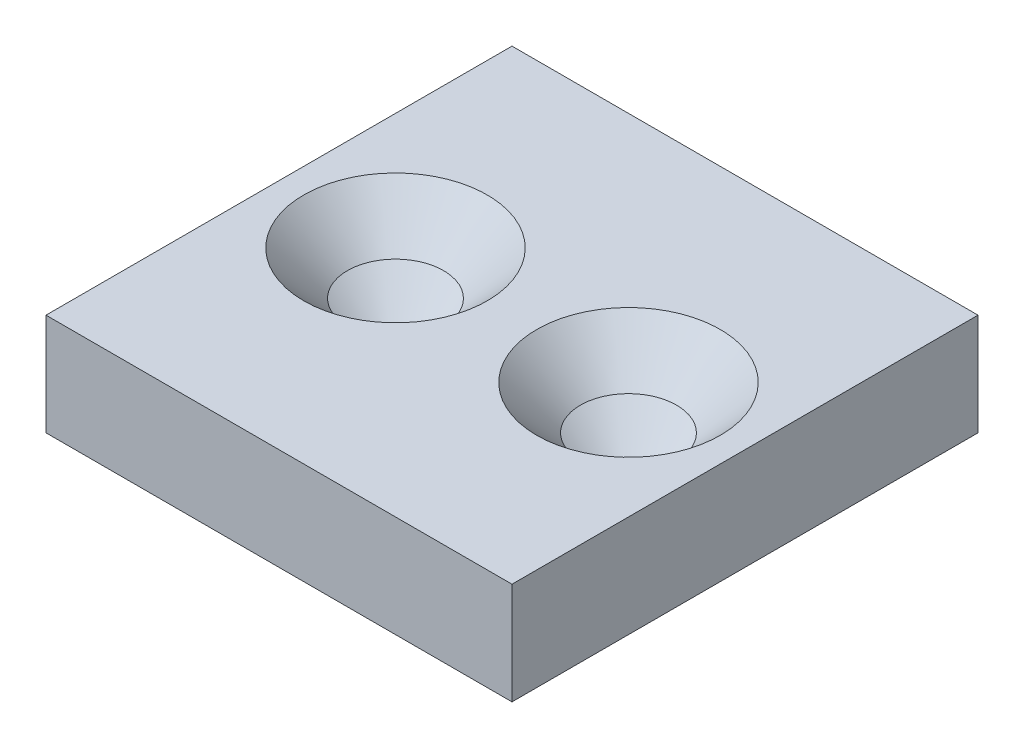
ISO-10303-21;
HEADER;
FILE_DESCRIPTION(('STEP AP214'),'2;1');
FILE_NAME('part.step','',(''),(''),'','','');
FILE_SCHEMA(('AUTOMOTIVE_DESIGN { 1 0 10303 214 1 1 1 1 }'));
ENDSEC;
DATA;
#1=APPLICATION_CONTEXT('core data for automotive mechanical design processes');
#2=APPLICATION_PROTOCOL_DEFINITION('international standard','automotive_design',2000,#1);
#3=PRODUCT_CONTEXT('',#1,'mechanical');
#4=PRODUCT('Part','Part','',(#3));
#5=PRODUCT_RELATED_PRODUCT_CATEGORY('part','',(#4));
#6=PRODUCT_DEFINITION_FORMATION('','',#4);
#7=PRODUCT_DEFINITION_CONTEXT('part definition',#1,'design');
#8=PRODUCT_DEFINITION('design','',#6,#7);
#9=PRODUCT_DEFINITION_SHAPE('','',#8);
#10=(LENGTH_UNIT() NAMED_UNIT(*) SI_UNIT(.MILLI.,.METRE.));
#11=(NAMED_UNIT(*) PLANE_ANGLE_UNIT() SI_UNIT($,.RADIAN.));
#12=(NAMED_UNIT(*) SI_UNIT($,.STERADIAN.) SOLID_ANGLE_UNIT());
#13=UNCERTAINTY_MEASURE_WITH_UNIT(LENGTH_MEASURE(1.E-05),#10,'distance_accuracy_value','');
#14=(GEOMETRIC_REPRESENTATION_CONTEXT(3) GLOBAL_UNCERTAINTY_ASSIGNED_CONTEXT((#13)) GLOBAL_UNIT_ASSIGNED_CONTEXT((#10,
#11,#12)) REPRESENTATION_CONTEXT('',''));
#15=CARTESIAN_POINT('',(0.,0.,0.));
#16=DIRECTION('',(0.,0.,1.));
#17=DIRECTION('',(1.,0.,0.));
#18=AXIS2_PLACEMENT_3D('',#15,#16,#17);
#19=CARTESIAN_POINT('',(-16.,7.,16.));
#20=DIRECTION('',(1.,0.,0.));
#21=DIRECTION('',(0.,0.,-1.));
#22=AXIS2_PLACEMENT_3D('',#19,#20,#21);
#23=PLANE('',#22);
#24=DIRECTION('',(0.,0.,1.));
#25=VECTOR('',#24,1.);
#26=CARTESIAN_POINT('',(-16.,0.,16.));
#27=LINE('',#26,#25);
#28=CARTESIAN_POINT('',(-16.,0.,-16.));
#29=VERTEX_POINT('',#28);
#30=CARTESIAN_POINT('',(-16.,0.,16.));
#31=VERTEX_POINT('',#30);
#32=EDGE_CURVE('E107',#29,#31,#27,.T.);
#33=ORIENTED_EDGE('',*,*,#32,.T.);
#34=DIRECTION('',(0.,-1.,0.));
#35=VECTOR('',#34,1.);
#36=CARTESIAN_POINT('',(-16.,7.,16.));
#37=LINE('',#36,#35);
#38=CARTESIAN_POINT('',(-16.,7.,16.));
#39=VERTEX_POINT('',#38);
#40=EDGE_CURVE('E11',#39,#31,#37,.T.);
#41=ORIENTED_EDGE('',*,*,#40,.F.);
#42=DIRECTION('',(0.,0.,1.));
#43=VECTOR('',#42,1.);
#44=CARTESIAN_POINT('',(-16.,7.,16.));
#45=LINE('',#44,#43);
#46=CARTESIAN_POINT('',(-16.,7.,-16.));
#47=VERTEX_POINT('',#46);
#48=EDGE_CURVE('E91',#47,#39,#45,.T.);
#49=ORIENTED_EDGE('',*,*,#48,.F.);
#50=DIRECTION('',(0.,-1.,0.));
#51=VECTOR('',#50,1.);
#52=CARTESIAN_POINT('',(-16.,7.,-16.));
#53=LINE('',#52,#51);
#54=EDGE_CURVE('E103',#47,#29,#53,.T.);
#55=ORIENTED_EDGE('',*,*,#54,.T.);
#56=EDGE_LOOP('',(#33,#41,#49,#55));
#57=FACE_BOUND('',#56,.T.);
#58=ADVANCED_FACE('F39',(#57),#23,.F.);
#59=CARTESIAN_POINT('',(16.,7.,16.));
#60=DIRECTION('',(0.,0.,-1.));
#61=DIRECTION('',(-1.,0.,0.));
#62=AXIS2_PLACEMENT_3D('',#59,#60,#61);
#63=PLANE('',#62);
#64=DIRECTION('',(1.,0.,0.));
#65=VECTOR('',#64,1.);
#66=CARTESIAN_POINT('',(16.,0.,16.));
#67=LINE('',#66,#65);
#68=CARTESIAN_POINT('',(16.,0.,16.));
#69=VERTEX_POINT('',#68);
#70=EDGE_CURVE('E96',#31,#69,#67,.T.);
#71=ORIENTED_EDGE('',*,*,#70,.T.);
#72=DIRECTION('',(0.,-1.,0.));
#73=VECTOR('',#72,1.);
#74=CARTESIAN_POINT('',(16.,7.,16.));
#75=LINE('',#74,#73);
#76=CARTESIAN_POINT('',(16.,7.,16.));
#77=VERTEX_POINT('',#76);
#78=EDGE_CURVE('E48',#77,#69,#75,.T.);
#79=ORIENTED_EDGE('',*,*,#78,.F.);
#80=DIRECTION('',(1.,0.,0.));
#81=VECTOR('',#80,1.);
#82=CARTESIAN_POINT('',(16.,7.,16.));
#83=LINE('',#82,#81);
#84=EDGE_CURVE('E86',#39,#77,#83,.T.);
#85=ORIENTED_EDGE('',*,*,#84,.F.);
#86=ORIENTED_EDGE('',*,*,#40,.T.);
#87=EDGE_LOOP('',(#71,#79,#85,#86));
#88=FACE_BOUND('',#87,.T.);
#89=ADVANCED_FACE('F95',(#88),#63,.F.);
#90=CARTESIAN_POINT('',(16.,7.,16.));
#91=DIRECTION('',(-1.,0.,0.));
#92=DIRECTION('',(0.,0.,1.));
#93=AXIS2_PLACEMENT_3D('',#90,#91,#92);
#94=PLANE('',#93);
#95=DIRECTION('',(0.,0.,-1.));
#96=VECTOR('',#95,1.);
#97=CARTESIAN_POINT('',(16.,0.,16.));
#98=LINE('',#97,#96);
#99=CARTESIAN_POINT('',(16.,0.,-16.));
#100=VERTEX_POINT('',#99);
#101=EDGE_CURVE('E73',#69,#100,#98,.T.);
#102=ORIENTED_EDGE('',*,*,#101,.T.);
#103=DIRECTION('',(0.,-1.,0.));
#104=VECTOR('',#103,1.);
#105=CARTESIAN_POINT('',(16.,7.,-16.));
#106=LINE('',#105,#104);
#107=CARTESIAN_POINT('',(16.,7.,-16.));
#108=VERTEX_POINT('',#107);
#109=EDGE_CURVE('E98',#108,#100,#106,.T.);
#110=ORIENTED_EDGE('',*,*,#109,.F.);
#111=DIRECTION('',(0.,0.,-1.));
#112=VECTOR('',#111,1.);
#113=CARTESIAN_POINT('',(16.,7.,16.));
#114=LINE('',#113,#112);
#115=EDGE_CURVE('E89',#77,#108,#114,.T.);
#116=ORIENTED_EDGE('',*,*,#115,.F.);
#117=ORIENTED_EDGE('',*,*,#78,.T.);
#118=EDGE_LOOP('',(#102,#110,#116,#117));
#119=FACE_BOUND('',#118,.T.);
#120=ADVANCED_FACE('F99',(#119),#94,.F.);
#121=CARTESIAN_POINT('',(16.,7.,-16.));
#122=DIRECTION('',(0.,0.,1.));
#123=DIRECTION('',(1.,0.,0.));
#124=AXIS2_PLACEMENT_3D('',#121,#122,#123);
#125=PLANE('',#124);
#126=DIRECTION('',(-1.,0.,0.));
#127=VECTOR('',#126,1.);
#128=CARTESIAN_POINT('',(16.,0.,-16.));
#129=LINE('',#128,#127);
#130=EDGE_CURVE('E79',#100,#29,#129,.T.);
#131=ORIENTED_EDGE('',*,*,#130,.T.);
#132=ORIENTED_EDGE('',*,*,#54,.F.);
#133=DIRECTION('',(-1.,0.,0.));
#134=VECTOR('',#133,1.);
#135=CARTESIAN_POINT('',(16.,7.,-16.));
#136=LINE('',#135,#134);
#137=EDGE_CURVE('E56',#108,#47,#136,.T.);
#138=ORIENTED_EDGE('',*,*,#137,.F.);
#139=ORIENTED_EDGE('',*,*,#109,.T.);
#140=EDGE_LOOP('',(#131,#132,#138,#139));
#141=FACE_BOUND('',#140,.T.);
#142=ADVANCED_FACE('F121',(#141),#125,.F.);
#143=CARTESIAN_POINT('',(0.,7.,0.));
#144=DIRECTION('',(0.,1.,0.));
#145=DIRECTION('',(0.,0.,1.));
#146=AXIS2_PLACEMENT_3D('',#143,#144,#145);
#147=PLANE('',#146);
#148=CARTESIAN_POINT('',(-7.99999999999999,7.,0.));
#149=DIRECTION('',(0.,1.,0.));
#150=DIRECTION('',(0.,0.,1.));
#151=AXIS2_PLACEMENT_3D('',#148,#149,#150);
#152=CIRCLE('',#151,6.3);
#153=CARTESIAN_POINT('',(-7.99999999999999,7.,6.3));
#154=VERTEX_POINT('',#153);
#155=EDGE_CURVE('E143',#154,#154,#152,.T.);
#156=ORIENTED_EDGE('',*,*,#155,.F.);
#157=EDGE_LOOP('',(#156));
#158=FACE_BOUND('',#157,.T.);
#159=CARTESIAN_POINT('',(8.00000000000001,7.,0.));
#160=DIRECTION('',(0.,1.,0.));
#161=DIRECTION('',(0.,0.,1.));
#162=AXIS2_PLACEMENT_3D('',#159,#160,#161);
#163=CIRCLE('',#162,6.3);
#164=CARTESIAN_POINT('',(8.00000000000001,7.,6.3));
#165=VERTEX_POINT('',#164);
#166=EDGE_CURVE('E111',#165,#165,#163,.T.);
#167=ORIENTED_EDGE('',*,*,#166,.F.);
#168=EDGE_LOOP('',(#167));
#169=FACE_BOUND('',#168,.T.);
#170=ORIENTED_EDGE('',*,*,#48,.T.);
#171=ORIENTED_EDGE('',*,*,#84,.T.);
#172=ORIENTED_EDGE('',*,*,#115,.T.);
#173=ORIENTED_EDGE('',*,*,#137,.T.);
#174=EDGE_LOOP('',(#170,#171,#172,#173));
#175=FACE_BOUND('',#174,.T.);
#176=ADVANCED_FACE('F87',(#158,#169,#175),#147,.T.);
#177=CARTESIAN_POINT('',(0.,0.,0.));
#178=DIRECTION('',(0.,1.,0.));
#179=DIRECTION('',(0.,0.,1.));
#180=AXIS2_PLACEMENT_3D('',#177,#178,#179);
#181=PLANE('',#180);
#182=CARTESIAN_POINT('',(-7.99999999999999,0.,0.));
#183=DIRECTION('',(0.,1.,0.));
#184=DIRECTION('',(0.,0.,1.));
#185=AXIS2_PLACEMENT_3D('',#182,#183,#184);
#186=CIRCLE('',#185,2.3);
#187=CARTESIAN_POINT('',(-7.99999999999999,0.,2.3));
#188=VERTEX_POINT('',#187);
#189=EDGE_CURVE('E155',#188,#188,#186,.T.);
#190=ORIENTED_EDGE('',*,*,#189,.T.);
#191=EDGE_LOOP('',(#190));
#192=FACE_BOUND('',#191,.T.);
#193=CARTESIAN_POINT('',(8.00000000000001,0.,0.));
#194=DIRECTION('',(0.,1.,0.));
#195=DIRECTION('',(0.,0.,1.));
#196=AXIS2_PLACEMENT_3D('',#193,#194,#195);
#197=CIRCLE('',#196,2.3);
#198=CARTESIAN_POINT('',(8.00000000000001,0.,2.3));
#199=VERTEX_POINT('',#198);
#200=EDGE_CURVE('E139',#199,#199,#197,.T.);
#201=ORIENTED_EDGE('',*,*,#200,.T.);
#202=EDGE_LOOP('',(#201));
#203=FACE_BOUND('',#202,.T.);
#204=ORIENTED_EDGE('',*,*,#32,.F.);
#205=ORIENTED_EDGE('',*,*,#130,.F.);
#206=ORIENTED_EDGE('',*,*,#101,.F.);
#207=ORIENTED_EDGE('',*,*,#70,.F.);
#208=EDGE_LOOP('',(#204,#205,#206,#207));
#209=FACE_BOUND('',#208,.T.);
#210=ADVANCED_FACE('F124',(#192,#203,#209),#181,.F.);
#211=CARTESIAN_POINT('',(8.00000000000001,7.,0.));
#212=DIRECTION('',(0.,1.,0.));
#213=DIRECTION('',(0.,0.,1.));
#214=AXIS2_PLACEMENT_3D('',#211,#212,#213);
#215=CONICAL_SURFACE('',#214,6.3,0.785398163397449);
#216=CARTESIAN_POINT('',(8.00000000000001,4.,0.));
#217=DIRECTION('',(0.,1.,0.));
#218=DIRECTION('',(0.,0.,1.));
#219=AXIS2_PLACEMENT_3D('',#216,#217,#218);
#220=CIRCLE('',#219,3.3);
#221=CARTESIAN_POINT('',(8.00000000000001,4.,3.3));
#222=VERTEX_POINT('',#221);
#223=EDGE_CURVE('E131',#222,#222,#220,.T.);
#224=ORIENTED_EDGE('',*,*,#223,.F.);
#225=EDGE_LOOP('',(#224));
#226=FACE_BOUND('',#225,.T.);
#227=ORIENTED_EDGE('',*,*,#166,.T.);
#228=EDGE_LOOP('',(#227));
#229=FACE_BOUND('',#228,.T.);
#230=ADVANCED_FACE('F186',(#226,#229),#215,.F.);
#231=CARTESIAN_POINT('',(14.3,4.,0.));
#232=DIRECTION('',(0.,1.,0.));
#233=DIRECTION('',(0.,0.,1.));
#234=AXIS2_PLACEMENT_3D('',#231,#232,#233);
#235=PLANE('',#234);
#236=CARTESIAN_POINT('',(8.00000000000001,4.,0.));
#237=DIRECTION('',(0.,1.,0.));
#238=DIRECTION('',(0.,0.,1.));
#239=AXIS2_PLACEMENT_3D('',#236,#237,#238);
#240=CIRCLE('',#239,6.3);
#241=CARTESIAN_POINT('',(8.00000000000001,4.,6.3));
#242=VERTEX_POINT('',#241);
#243=EDGE_CURVE('E135',#242,#242,#240,.T.);
#244=ORIENTED_EDGE('',*,*,#243,.F.);
#245=EDGE_LOOP('',(#244));
#246=FACE_BOUND('',#245,.T.);
#247=ORIENTED_EDGE('',*,*,#223,.T.);
#248=EDGE_LOOP('',(#247));
#249=FACE_BOUND('',#248,.T.);
#250=ADVANCED_FACE('F188',(#246,#249),#235,.F.);
#251=CARTESIAN_POINT('',(8.00000000000001,4.,0.));
#252=DIRECTION('',(0.,1.,0.));
#253=DIRECTION('',(0.,0.,1.));
#254=AXIS2_PLACEMENT_3D('',#251,#252,#253);
#255=CONICAL_SURFACE('',#254,6.3,0.785398163397448);
#256=ORIENTED_EDGE('',*,*,#200,.F.);
#257=EDGE_LOOP('',(#256));
#258=FACE_BOUND('',#257,.T.);
#259=ORIENTED_EDGE('',*,*,#243,.T.);
#260=EDGE_LOOP('',(#259));
#261=FACE_BOUND('',#260,.T.);
#262=ADVANCED_FACE('F177',(#258,#261),#255,.F.);
#263=CARTESIAN_POINT('',(-7.99999999999999,7.,0.));
#264=DIRECTION('',(0.,1.,0.));
#265=DIRECTION('',(0.,0.,1.));
#266=AXIS2_PLACEMENT_3D('',#263,#264,#265);
#267=CONICAL_SURFACE('',#266,6.3,0.785398163397449);
#268=CARTESIAN_POINT('',(-7.99999999999999,4.,0.));
#269=DIRECTION('',(0.,1.,0.));
#270=DIRECTION('',(0.,0.,1.));
#271=AXIS2_PLACEMENT_3D('',#268,#269,#270);
#272=CIRCLE('',#271,3.3);
#273=CARTESIAN_POINT('',(-7.99999999999999,4.,3.3));
#274=VERTEX_POINT('',#273);
#275=EDGE_CURVE('E147',#274,#274,#272,.T.);
#276=ORIENTED_EDGE('',*,*,#275,.F.);
#277=EDGE_LOOP('',(#276));
#278=FACE_BOUND('',#277,.T.);
#279=ORIENTED_EDGE('',*,*,#155,.T.);
#280=EDGE_LOOP('',(#279));
#281=FACE_BOUND('',#280,.T.);
#282=ADVANCED_FACE('F171',(#278,#281),#267,.F.);
#283=CARTESIAN_POINT('',(-1.69999999999999,4.,0.));
#284=DIRECTION('',(0.,1.,0.));
#285=DIRECTION('',(0.,0.,1.));
#286=AXIS2_PLACEMENT_3D('',#283,#284,#285);
#287=PLANE('',#286);
#288=CARTESIAN_POINT('',(-7.99999999999999,4.,0.));
#289=DIRECTION('',(0.,1.,0.));
#290=DIRECTION('',(0.,0.,1.));
#291=AXIS2_PLACEMENT_3D('',#288,#289,#290);
#292=CIRCLE('',#291,6.3);
#293=CARTESIAN_POINT('',(-7.99999999999999,4.,6.3));
#294=VERTEX_POINT('',#293);
#295=EDGE_CURVE('E151',#294,#294,#292,.T.);
#296=ORIENTED_EDGE('',*,*,#295,.F.);
#297=EDGE_LOOP('',(#296));
#298=FACE_BOUND('',#297,.T.);
#299=ORIENTED_EDGE('',*,*,#275,.T.);
#300=EDGE_LOOP('',(#299));
#301=FACE_BOUND('',#300,.T.);
#302=ADVANCED_FACE('F165',(#298,#301),#287,.F.);
#303=CARTESIAN_POINT('',(-7.99999999999999,4.,0.));
#304=DIRECTION('',(0.,1.,0.));
#305=DIRECTION('',(0.,0.,1.));
#306=AXIS2_PLACEMENT_3D('',#303,#304,#305);
#307=CONICAL_SURFACE('',#306,6.3,0.785398163397448);
#308=ORIENTED_EDGE('',*,*,#189,.F.);
#309=EDGE_LOOP('',(#308));
#310=FACE_BOUND('',#309,.T.);
#311=ORIENTED_EDGE('',*,*,#295,.T.);
#312=EDGE_LOOP('',(#311));
#313=FACE_BOUND('',#312,.T.);
#314=ADVANCED_FACE('F162',(#310,#313),#307,.F.);
#315=CLOSED_SHELL('',(#58,#89,#120,#142,#176,#210,#230,#250,#262,#282,#302,#314));
#316=MANIFOLD_SOLID_BREP('B2',#315);
#317=ADVANCED_BREP_SHAPE_REPRESENTATION('',(#18,#316),#14);
#318=SHAPE_DEFINITION_REPRESENTATION(#9,#317);
ENDSEC;
END-ISO-10303-21;
